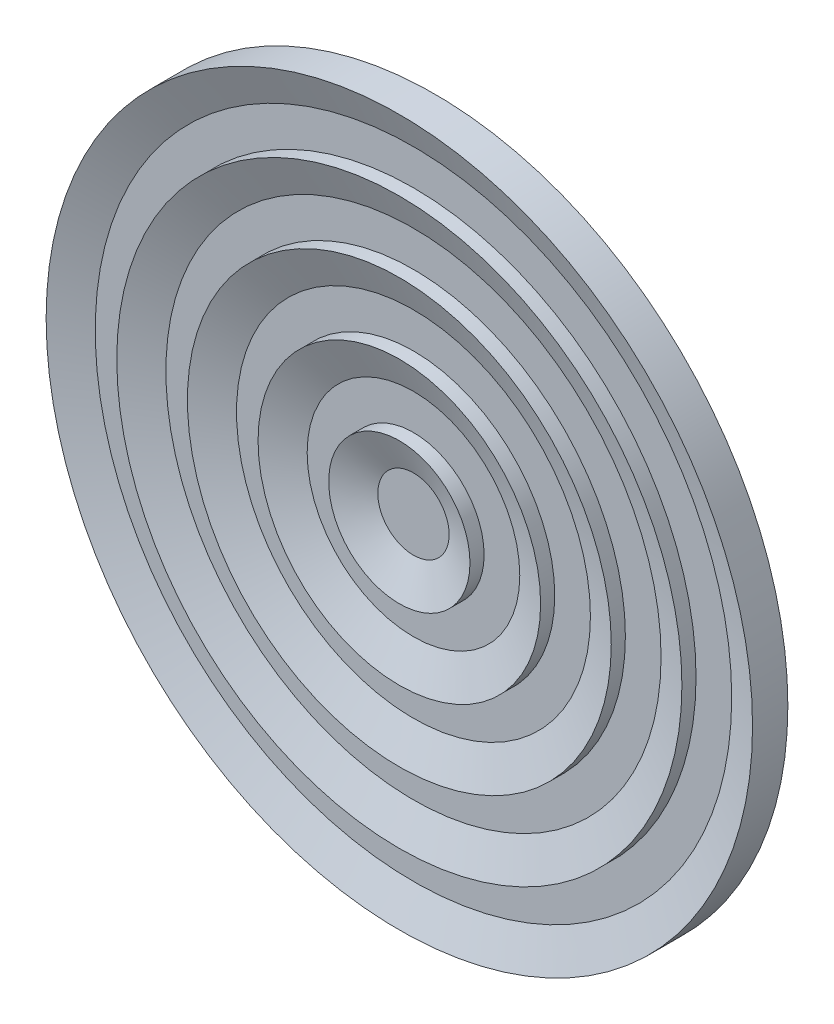
ISO-10303-21;
HEADER;
FILE_DESCRIPTION(('STEP AP214'),'2;1');
FILE_NAME('part.step','',(''),(''),'','','');
FILE_SCHEMA(('AUTOMOTIVE_DESIGN { 1 0 10303 214 1 1 1 1 }'));
ENDSEC;
DATA;
#1=APPLICATION_CONTEXT('core data for automotive mechanical design processes');
#2=APPLICATION_PROTOCOL_DEFINITION('international standard','automotive_design',2000,#1);
#3=PRODUCT_CONTEXT('',#1,'mechanical');
#4=PRODUCT('Part','Part','',(#3));
#5=PRODUCT_RELATED_PRODUCT_CATEGORY('part','',(#4));
#6=PRODUCT_DEFINITION_FORMATION('','',#4);
#7=PRODUCT_DEFINITION_CONTEXT('part definition',#1,'design');
#8=PRODUCT_DEFINITION('design','',#6,#7);
#9=PRODUCT_DEFINITION_SHAPE('','',#8);
#10=(LENGTH_UNIT() NAMED_UNIT(*) SI_UNIT(.MILLI.,.METRE.));
#11=(NAMED_UNIT(*) PLANE_ANGLE_UNIT() SI_UNIT($,.RADIAN.));
#12=(NAMED_UNIT(*) SI_UNIT($,.STERADIAN.) SOLID_ANGLE_UNIT());
#13=UNCERTAINTY_MEASURE_WITH_UNIT(LENGTH_MEASURE(1.E-05),#10,'distance_accuracy_value','');
#14=(GEOMETRIC_REPRESENTATION_CONTEXT(3) GLOBAL_UNCERTAINTY_ASSIGNED_CONTEXT((#13)) GLOBAL_UNIT_ASSIGNED_CONTEXT((#10,
#11,#12)) REPRESENTATION_CONTEXT('',''));
#15=CARTESIAN_POINT('',(0.,0.,0.));
#16=DIRECTION('',(0.,0.,1.));
#17=DIRECTION('',(1.,0.,0.));
#18=AXIS2_PLACEMENT_3D('',#15,#16,#17);
#19=CARTESIAN_POINT('',(0.,0.,0.5));
#20=DIRECTION('',(0.,0.,-1.));
#21=DIRECTION('',(-1.,0.,0.));
#22=AXIS2_PLACEMENT_3D('',#19,#20,#21);
#23=CYLINDRICAL_SURFACE('',#22,5.);
#24=CARTESIAN_POINT('',(0.,0.,0.5));
#25=DIRECTION('',(0.,0.,1.));
#26=DIRECTION('',(1.,0.,0.));
#27=AXIS2_PLACEMENT_3D('',#24,#25,#26);
#28=CIRCLE('',#27,5.);
#29=CARTESIAN_POINT('',(5.,0.,0.5));
#30=VERTEX_POINT('',#29);
#31=EDGE_CURVE('E118',#30,#30,#28,.T.);
#32=ORIENTED_EDGE('',*,*,#31,.F.);
#33=EDGE_LOOP('',(#32));
#34=FACE_BOUND('',#33,.T.);
#35=CARTESIAN_POINT('',(0.,0.,0.));
#36=DIRECTION('',(0.,0.,1.));
#37=DIRECTION('',(1.,0.,0.));
#38=AXIS2_PLACEMENT_3D('',#35,#36,#37);
#39=CIRCLE('',#38,5.);
#40=CARTESIAN_POINT('',(5.,0.,0.));
#41=VERTEX_POINT('',#40);
#42=EDGE_CURVE('E119',#41,#41,#39,.T.);
#43=ORIENTED_EDGE('',*,*,#42,.T.);
#44=EDGE_LOOP('',(#43));
#45=FACE_BOUND('',#44,.T.);
#46=ADVANCED_FACE('F94',(#34,#45),#23,.T.);
#47=CARTESIAN_POINT('',(0.,0.,0.));
#48=DIRECTION('',(0.,0.,1.));
#49=DIRECTION('',(1.,0.,0.));
#50=AXIS2_PLACEMENT_3D('',#47,#48,#49);
#51=PLANE('',#50);
#52=ORIENTED_EDGE('',*,*,#42,.F.);
#53=EDGE_LOOP('',(#52));
#54=FACE_BOUND('',#53,.T.);
#55=ADVANCED_FACE('F163',(#54),#51,.F.);
#56=CARTESIAN_POINT('',(0.,0.,0.3));
#57=DIRECTION('',(0.,0.,1.));
#58=DIRECTION('',(1.,0.,0.));
#59=AXIS2_PLACEMENT_3D('',#56,#57,#58);
#60=CYLINDRICAL_SURFACE('',#59,4.);
#61=CARTESIAN_POINT('',(0.,0.,0.3));
#62=DIRECTION('',(0.,0.,1.));
#63=DIRECTION('',(1.,0.,0.));
#64=AXIS2_PLACEMENT_3D('',#61,#62,#63);
#65=CIRCLE('',#64,4.);
#66=CARTESIAN_POINT('',(4.,0.,0.3));
#67=VERTEX_POINT('',#66);
#68=EDGE_CURVE('E140',#67,#67,#65,.T.);
#69=ORIENTED_EDGE('',*,*,#68,.T.);
#70=EDGE_LOOP('',(#69));
#71=FACE_BOUND('',#70,.T.);
#72=CARTESIAN_POINT('',(0.,0.,0.5));
#73=DIRECTION('',(0.,0.,1.));
#74=DIRECTION('',(1.,0.,0.));
#75=AXIS2_PLACEMENT_3D('',#72,#73,#74);
#76=CIRCLE('',#75,4.);
#77=CARTESIAN_POINT('',(4.,0.,0.5));
#78=VERTEX_POINT('',#77);
#79=EDGE_CURVE('E143',#78,#78,#76,.T.);
#80=ORIENTED_EDGE('',*,*,#79,.F.);
#81=EDGE_LOOP('',(#80));
#82=FACE_BOUND('',#81,.T.);
#83=ADVANCED_FACE('F149',(#71,#82),#60,.T.);
#84=CARTESIAN_POINT('',(0.,0.,0.3));
#85=DIRECTION('',(0.,0.,1.));
#86=DIRECTION('',(1.,0.,0.));
#87=AXIS2_PLACEMENT_3D('',#84,#85,#86);
#88=PLANE('',#87);
#89=CARTESIAN_POINT('',(0.,0.,0.3));
#90=DIRECTION('',(0.,0.,1.));
#91=DIRECTION('',(1.,0.,0.));
#92=AXIS2_PLACEMENT_3D('',#89,#90,#91);
#93=CIRCLE('',#92,4.50498262931675);
#94=CARTESIAN_POINT('',(4.50498262931675,0.,0.3));
#95=VERTEX_POINT('',#94);
#96=EDGE_CURVE('E11',#95,#95,#93,.T.);
#97=ORIENTED_EDGE('',*,*,#96,.T.);
#98=EDGE_LOOP('',(#97));
#99=FACE_BOUND('',#98,.T.);
#100=ORIENTED_EDGE('',*,*,#68,.F.);
#101=EDGE_LOOP('',(#100));
#102=FACE_BOUND('',#101,.T.);
#103=ADVANCED_FACE('F152',(#99,#102),#88,.T.);
#104=CARTESIAN_POINT('',(0.,0.,0.3));
#105=DIRECTION('',(0.,0.,1.));
#106=DIRECTION('',(1.,0.,0.));
#107=AXIS2_PLACEMENT_3D('',#104,#105,#106);
#108=CYLINDRICAL_SURFACE('',#107,3.);
#109=CARTESIAN_POINT('',(0.,0.,0.3));
#110=DIRECTION('',(0.,0.,1.));
#111=DIRECTION('',(1.,0.,0.));
#112=AXIS2_PLACEMENT_3D('',#109,#110,#111);
#113=CIRCLE('',#112,3.);
#114=CARTESIAN_POINT('',(3.,0.,0.3));
#115=VERTEX_POINT('',#114);
#116=EDGE_CURVE('E134',#115,#115,#113,.T.);
#117=ORIENTED_EDGE('',*,*,#116,.T.);
#118=EDGE_LOOP('',(#117));
#119=FACE_BOUND('',#118,.T.);
#120=CARTESIAN_POINT('',(0.,0.,0.5));
#121=DIRECTION('',(0.,0.,1.));
#122=DIRECTION('',(1.,0.,0.));
#123=AXIS2_PLACEMENT_3D('',#120,#121,#122);
#124=CIRCLE('',#123,3.);
#125=CARTESIAN_POINT('',(3.,0.,0.5));
#126=VERTEX_POINT('',#125);
#127=EDGE_CURVE('E137',#126,#126,#124,.T.);
#128=ORIENTED_EDGE('',*,*,#127,.F.);
#129=EDGE_LOOP('',(#128));
#130=FACE_BOUND('',#129,.T.);
#131=ADVANCED_FACE('F154',(#119,#130),#108,.T.);
#132=CARTESIAN_POINT('',(0.,0.,0.3));
#133=DIRECTION('',(0.,0.,1.));
#134=DIRECTION('',(1.,0.,0.));
#135=AXIS2_PLACEMENT_3D('',#132,#133,#134);
#136=PLANE('',#135);
#137=CARTESIAN_POINT('',(0.,0.,0.3));
#138=DIRECTION('',(0.,0.,1.));
#139=DIRECTION('',(1.,0.,0.));
#140=AXIS2_PLACEMENT_3D('',#137,#138,#139);
#141=CIRCLE('',#140,3.50498262931675);
#142=CARTESIAN_POINT('',(3.50498262931675,0.,0.3));
#143=VERTEX_POINT('',#142);
#144=EDGE_CURVE('E102',#143,#143,#141,.T.);
#145=ORIENTED_EDGE('',*,*,#144,.T.);
#146=EDGE_LOOP('',(#145));
#147=FACE_BOUND('',#146,.T.);
#148=ORIENTED_EDGE('',*,*,#116,.F.);
#149=EDGE_LOOP('',(#148));
#150=FACE_BOUND('',#149,.T.);
#151=ADVANCED_FACE('F160',(#147,#150),#136,.T.);
#152=CARTESIAN_POINT('',(0.,0.,0.3));
#153=DIRECTION('',(0.,0.,1.));
#154=DIRECTION('',(1.,0.,0.));
#155=AXIS2_PLACEMENT_3D('',#152,#153,#154);
#156=CYLINDRICAL_SURFACE('',#155,2.);
#157=CARTESIAN_POINT('',(0.,0.,0.3));
#158=DIRECTION('',(0.,0.,1.));
#159=DIRECTION('',(1.,0.,0.));
#160=AXIS2_PLACEMENT_3D('',#157,#158,#159);
#161=CIRCLE('',#160,2.);
#162=CARTESIAN_POINT('',(2.,0.,0.3));
#163=VERTEX_POINT('',#162);
#164=EDGE_CURVE('E128',#163,#163,#161,.T.);
#165=ORIENTED_EDGE('',*,*,#164,.T.);
#166=EDGE_LOOP('',(#165));
#167=FACE_BOUND('',#166,.T.);
#168=CARTESIAN_POINT('',(0.,0.,0.5));
#169=DIRECTION('',(0.,0.,1.));
#170=DIRECTION('',(1.,0.,0.));
#171=AXIS2_PLACEMENT_3D('',#168,#169,#170);
#172=CIRCLE('',#171,2.);
#173=CARTESIAN_POINT('',(2.,0.,0.5));
#174=VERTEX_POINT('',#173);
#175=EDGE_CURVE('E131',#174,#174,#172,.T.);
#176=ORIENTED_EDGE('',*,*,#175,.F.);
#177=EDGE_LOOP('',(#176));
#178=FACE_BOUND('',#177,.T.);
#179=ADVANCED_FACE('F266',(#167,#178),#156,.T.);
#180=CARTESIAN_POINT('',(0.,0.,0.3));
#181=DIRECTION('',(0.,0.,1.));
#182=DIRECTION('',(1.,0.,0.));
#183=AXIS2_PLACEMENT_3D('',#180,#181,#182);
#184=PLANE('',#183);
#185=CARTESIAN_POINT('',(0.,0.,0.3));
#186=DIRECTION('',(0.,0.,1.));
#187=DIRECTION('',(1.,0.,0.));
#188=AXIS2_PLACEMENT_3D('',#185,#186,#187);
#189=CIRCLE('',#188,2.50498262931675);
#190=CARTESIAN_POINT('',(2.50498262931675,0.,0.3));
#191=VERTEX_POINT('',#190);
#192=EDGE_CURVE('E106',#191,#191,#189,.T.);
#193=ORIENTED_EDGE('',*,*,#192,.T.);
#194=EDGE_LOOP('',(#193));
#195=FACE_BOUND('',#194,.T.);
#196=ORIENTED_EDGE('',*,*,#164,.F.);
#197=EDGE_LOOP('',(#196));
#198=FACE_BOUND('',#197,.T.);
#199=ADVANCED_FACE('F261',(#195,#198),#184,.T.);
#200=CARTESIAN_POINT('',(0.,0.,0.3));
#201=DIRECTION('',(0.,0.,1.));
#202=DIRECTION('',(1.,0.,0.));
#203=AXIS2_PLACEMENT_3D('',#200,#201,#202);
#204=CYLINDRICAL_SURFACE('',#203,1.);
#205=CARTESIAN_POINT('',(0.,0.,0.3));
#206=DIRECTION('',(0.,0.,1.));
#207=DIRECTION('',(1.,0.,0.));
#208=AXIS2_PLACEMENT_3D('',#205,#206,#207);
#209=CIRCLE('',#208,1.);
#210=CARTESIAN_POINT('',(1.,0.,0.3));
#211=VERTEX_POINT('',#210);
#212=EDGE_CURVE('E122',#211,#211,#209,.T.);
#213=ORIENTED_EDGE('',*,*,#212,.T.);
#214=EDGE_LOOP('',(#213));
#215=FACE_BOUND('',#214,.T.);
#216=CARTESIAN_POINT('',(0.,0.,0.5));
#217=DIRECTION('',(0.,0.,1.));
#218=DIRECTION('',(1.,0.,0.));
#219=AXIS2_PLACEMENT_3D('',#216,#217,#218);
#220=CIRCLE('',#219,1.);
#221=CARTESIAN_POINT('',(1.,0.,0.5));
#222=VERTEX_POINT('',#221);
#223=EDGE_CURVE('E125',#222,#222,#220,.T.);
#224=ORIENTED_EDGE('',*,*,#223,.F.);
#225=EDGE_LOOP('',(#224));
#226=FACE_BOUND('',#225,.T.);
#227=ADVANCED_FACE('F253',(#215,#226),#204,.T.);
#228=CARTESIAN_POINT('',(0.,0.,0.3));
#229=DIRECTION('',(0.,0.,1.));
#230=DIRECTION('',(1.,0.,0.));
#231=AXIS2_PLACEMENT_3D('',#228,#229,#230);
#232=PLANE('',#231);
#233=CARTESIAN_POINT('',(0.,0.,0.3));
#234=DIRECTION('',(0.,0.,1.));
#235=DIRECTION('',(1.,0.,0.));
#236=AXIS2_PLACEMENT_3D('',#233,#234,#235);
#237=CIRCLE('',#236,1.50498262931675);
#238=CARTESIAN_POINT('',(1.50498262931675,0.,0.3));
#239=VERTEX_POINT('',#238);
#240=EDGE_CURVE('E110',#239,#239,#237,.T.);
#241=ORIENTED_EDGE('',*,*,#240,.T.);
#242=EDGE_LOOP('',(#241));
#243=FACE_BOUND('',#242,.T.);
#244=ORIENTED_EDGE('',*,*,#212,.F.);
#245=EDGE_LOOP('',(#244));
#246=FACE_BOUND('',#245,.T.);
#247=ADVANCED_FACE('F244',(#243,#246),#232,.T.);
#248=CARTESIAN_POINT('',(0.,0.,0.3));
#249=DIRECTION('',(0.,0.,1.));
#250=DIRECTION('',(1.,0.,0.));
#251=AXIS2_PLACEMENT_3D('',#248,#249,#250);
#252=PLANE('',#251);
#253=CARTESIAN_POINT('',(0.,0.,0.3));
#254=DIRECTION('',(0.,0.,1.));
#255=DIRECTION('',(1.,0.,0.));
#256=AXIS2_PLACEMENT_3D('',#253,#254,#255);
#257=CIRCLE('',#256,0.504982629316753);
#258=CARTESIAN_POINT('',(0.504982629316753,0.,0.3));
#259=VERTEX_POINT('',#258);
#260=EDGE_CURVE('E115',#259,#259,#257,.T.);
#261=ORIENTED_EDGE('',*,*,#260,.T.);
#262=EDGE_LOOP('',(#261));
#263=FACE_BOUND('',#262,.T.);
#264=ADVANCED_FACE('F185',(#263),#252,.T.);
#265=CARTESIAN_POINT('',(0.,0.,0.297986887082417));
#266=DIRECTION('',(0.,0.,1.));
#267=DIRECTION('',(1.,0.,0.));
#268=AXIS2_PLACEMENT_3D('',#265,#266,#267);
#269=CONICAL_SURFACE('',#268,0.5,1.18682389135614);
#270=ORIENTED_EDGE('',*,*,#223,.T.);
#271=EDGE_LOOP('',(#270));
#272=FACE_BOUND('',#271,.T.);
#273=ORIENTED_EDGE('',*,*,#260,.F.);
#274=EDGE_LOOP('',(#273));
#275=FACE_BOUND('',#274,.T.);
#276=ADVANCED_FACE('F178',(#272,#275),#269,.F.);
#277=CARTESIAN_POINT('',(0.,0.,0.297986887082417));
#278=DIRECTION('',(0.,0.,1.));
#279=DIRECTION('',(1.,0.,0.));
#280=AXIS2_PLACEMENT_3D('',#277,#278,#279);
#281=CONICAL_SURFACE('',#280,1.5,1.18682389135614);
#282=ORIENTED_EDGE('',*,*,#175,.T.);
#283=EDGE_LOOP('',(#282));
#284=FACE_BOUND('',#283,.T.);
#285=ORIENTED_EDGE('',*,*,#240,.F.);
#286=EDGE_LOOP('',(#285));
#287=FACE_BOUND('',#286,.T.);
#288=ADVANCED_FACE('F184',(#284,#287),#281,.F.);
#289=CARTESIAN_POINT('',(0.,0.,0.297986887082417));
#290=DIRECTION('',(0.,0.,1.));
#291=DIRECTION('',(1.,0.,0.));
#292=AXIS2_PLACEMENT_3D('',#289,#290,#291);
#293=CONICAL_SURFACE('',#292,2.5,1.18682389135614);
#294=ORIENTED_EDGE('',*,*,#127,.T.);
#295=EDGE_LOOP('',(#294));
#296=FACE_BOUND('',#295,.T.);
#297=ORIENTED_EDGE('',*,*,#192,.F.);
#298=EDGE_LOOP('',(#297));
#299=FACE_BOUND('',#298,.T.);
#300=ADVANCED_FACE('F192',(#296,#299),#293,.F.);
#301=CARTESIAN_POINT('',(0.,0.,0.297986887082417));
#302=DIRECTION('',(0.,0.,1.));
#303=DIRECTION('',(1.,0.,0.));
#304=AXIS2_PLACEMENT_3D('',#301,#302,#303);
#305=CONICAL_SURFACE('',#304,3.5,1.18682389135614);
#306=ORIENTED_EDGE('',*,*,#79,.T.);
#307=EDGE_LOOP('',(#306));
#308=FACE_BOUND('',#307,.T.);
#309=ORIENTED_EDGE('',*,*,#144,.F.);
#310=EDGE_LOOP('',(#309));
#311=FACE_BOUND('',#310,.T.);
#312=ADVANCED_FACE('F198',(#308,#311),#305,.F.);
#313=CARTESIAN_POINT('',(0.,0.,0.297986887082417));
#314=DIRECTION('',(0.,0.,1.));
#315=DIRECTION('',(1.,0.,0.));
#316=AXIS2_PLACEMENT_3D('',#313,#314,#315);
#317=CONICAL_SURFACE('',#316,4.5,1.18682389135614);
#318=ORIENTED_EDGE('',*,*,#31,.T.);
#319=EDGE_LOOP('',(#318));
#320=FACE_BOUND('',#319,.T.);
#321=ORIENTED_EDGE('',*,*,#96,.F.);
#322=EDGE_LOOP('',(#321));
#323=FACE_BOUND('',#322,.T.);
#324=ADVANCED_FACE('F97',(#320,#323),#317,.F.);
#325=CLOSED_SHELL('',(#46,#55,#83,#103,#131,#151,#179,#199,#227,#247,#264,#276,#288,#300,#312,#324));
#326=MANIFOLD_SOLID_BREP('B2',#325);
#327=ADVANCED_BREP_SHAPE_REPRESENTATION('',(#18,#326),#14);
#328=SHAPE_DEFINITION_REPRESENTATION(#9,#327);
ENDSEC;
END-ISO-10303-21;
